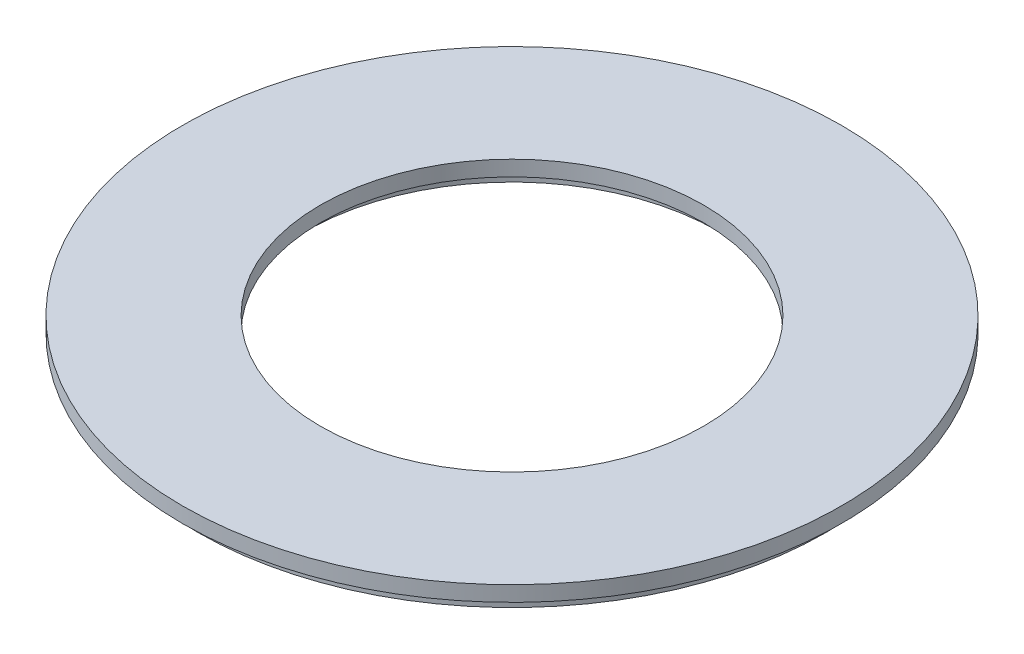
ISO-10303-21;
HEADER;
FILE_DESCRIPTION(('STEP AP214'),'2;1');
FILE_NAME('part.step','',(''),(''),'','','');
FILE_SCHEMA(('AUTOMOTIVE_DESIGN { 1 0 10303 214 1 1 1 1 }'));
ENDSEC;
DATA;
#1=APPLICATION_CONTEXT('core data for automotive mechanical design processes');
#2=APPLICATION_PROTOCOL_DEFINITION('international standard','automotive_design',2000,#1);
#3=PRODUCT_CONTEXT('',#1,'mechanical');
#4=PRODUCT('Part','Part','',(#3));
#5=PRODUCT_RELATED_PRODUCT_CATEGORY('part','',(#4));
#6=PRODUCT_DEFINITION_FORMATION('','',#4);
#7=PRODUCT_DEFINITION_CONTEXT('part definition',#1,'design');
#8=PRODUCT_DEFINITION('design','',#6,#7);
#9=PRODUCT_DEFINITION_SHAPE('','',#8);
#10=(LENGTH_UNIT() NAMED_UNIT(*) SI_UNIT(.MILLI.,.METRE.));
#11=(NAMED_UNIT(*) PLANE_ANGLE_UNIT() SI_UNIT($,.RADIAN.));
#12=(NAMED_UNIT(*) SI_UNIT($,.STERADIAN.) SOLID_ANGLE_UNIT());
#13=UNCERTAINTY_MEASURE_WITH_UNIT(LENGTH_MEASURE(1.E-05),#10,'distance_accuracy_value','');
#14=(GEOMETRIC_REPRESENTATION_CONTEXT(3) GLOBAL_UNCERTAINTY_ASSIGNED_CONTEXT((#13)) GLOBAL_UNIT_ASSIGNED_CONTEXT((#10,
#11,#12)) REPRESENTATION_CONTEXT('',''));
#15=CARTESIAN_POINT('',(0.,0.,0.));
#16=DIRECTION('',(0.,0.,1.));
#17=DIRECTION('',(1.,0.,0.));
#18=AXIS2_PLACEMENT_3D('',#15,#16,#17);
#19=CARTESIAN_POINT('',(0.,0.,0.));
#20=DIRECTION('',(0.,1.,0.));
#21=DIRECTION('',(0.,0.,1.));
#22=AXIS2_PLACEMENT_3D('',#19,#20,#21);
#23=PLANE('',#22);
#24=CARTESIAN_POINT('',(0.,0.,0.));
#25=DIRECTION('',(0.,1.,0.));
#26=DIRECTION('',(0.,0.,1.));
#27=AXIS2_PLACEMENT_3D('',#24,#25,#26);
#28=CIRCLE('',#27,12.5);
#29=CARTESIAN_POINT('',(0.,0.,12.5));
#30=VERTEX_POINT('',#29);
#31=EDGE_CURVE('E49',#30,#30,#28,.T.);
#32=ORIENTED_EDGE('',*,*,#31,.T.);
#33=EDGE_LOOP('',(#32));
#34=FACE_BOUND('',#33,.T.);
#35=CARTESIAN_POINT('',(0.,0.,0.));
#36=DIRECTION('',(0.,-1.,0.));
#37=DIRECTION('',(0.,0.,-1.));
#38=AXIS2_PLACEMENT_3D('',#35,#36,#37);
#39=CIRCLE('',#38,13.5);
#40=CARTESIAN_POINT('',(0.,0.,-13.5));
#41=VERTEX_POINT('',#40);
#42=EDGE_CURVE('E58',#41,#41,#39,.T.);
#43=ORIENTED_EDGE('',*,*,#42,.T.);
#44=EDGE_LOOP('',(#43));
#45=FACE_BOUND('',#44,.T.);
#46=ADVANCED_FACE('F31',(#34,#45),#23,.F.);
#47=CARTESIAN_POINT('',(0.,1.,0.));
#48=DIRECTION('',(0.,1.,0.));
#49=DIRECTION('',(0.,0.,1.));
#50=AXIS2_PLACEMENT_3D('',#47,#48,#49);
#51=PLANE('',#50);
#52=CARTESIAN_POINT('',(0.,1.,0.));
#53=DIRECTION('',(0.,1.,0.));
#54=DIRECTION('',(0.,0.,1.));
#55=AXIS2_PLACEMENT_3D('',#52,#53,#54);
#56=CIRCLE('',#55,21.5);
#57=CARTESIAN_POINT('',(0.,1.,21.5));
#58=VERTEX_POINT('',#57);
#59=EDGE_CURVE('E38',#58,#58,#56,.T.);
#60=ORIENTED_EDGE('',*,*,#59,.T.);
#61=EDGE_LOOP('',(#60));
#62=FACE_BOUND('',#61,.T.);
#63=CARTESIAN_POINT('',(0.,1.,0.));
#64=DIRECTION('',(0.,1.,0.));
#65=DIRECTION('',(0.,0.,1.));
#66=AXIS2_PLACEMENT_3D('',#63,#64,#65);
#67=CIRCLE('',#66,12.5);
#68=CARTESIAN_POINT('',(0.,1.,12.5));
#69=VERTEX_POINT('',#68);
#70=EDGE_CURVE('E47',#69,#69,#67,.T.);
#71=ORIENTED_EDGE('',*,*,#70,.F.);
#72=EDGE_LOOP('',(#71));
#73=FACE_BOUND('',#72,.T.);
#74=ADVANCED_FACE('F83',(#62,#73),#51,.T.);
#75=CARTESIAN_POINT('',(0.,0.,0.));
#76=DIRECTION('',(0.,1.,0.));
#77=DIRECTION('',(0.,0.,1.));
#78=AXIS2_PLACEMENT_3D('',#75,#76,#77);
#79=CIRCLE('',#78,20.5);
#80=CARTESIAN_POINT('',(0.,0.,20.5));
#81=VERTEX_POINT('',#80);
#82=EDGE_CURVE('E10',#81,#81,#79,.F.);
#83=ORIENTED_EDGE('',*,*,#82,.F.);
#84=EDGE_LOOP('',(#83));
#85=FACE_BOUND('',#84,.T.);
#86=CARTESIAN_POINT('',(0.,0.,0.));
#87=DIRECTION('',(0.,1.,0.));
#88=DIRECTION('',(0.,0.,1.));
#89=AXIS2_PLACEMENT_3D('',#86,#87,#88);
#90=CIRCLE('',#89,21.5);
#91=CARTESIAN_POINT('',(0.,0.,21.5));
#92=VERTEX_POINT('',#91);
#93=EDGE_CURVE('E42',#92,#92,#90,.T.);
#94=ORIENTED_EDGE('',*,*,#93,.F.);
#95=EDGE_LOOP('',(#94));
#96=FACE_BOUND('',#95,.T.);
#97=ADVANCED_FACE('F85',(#85,#96),#23,.F.);
#98=CARTESIAN_POINT('',(0.,1.,0.));
#99=DIRECTION('',(0.,-1.,0.));
#100=DIRECTION('',(0.,0.,-1.));
#101=AXIS2_PLACEMENT_3D('',#98,#99,#100);
#102=CYLINDRICAL_SURFACE('',#101,21.5);
#103=ORIENTED_EDGE('',*,*,#59,.F.);
#104=EDGE_LOOP('',(#103));
#105=FACE_BOUND('',#104,.T.);
#106=ORIENTED_EDGE('',*,*,#93,.T.);
#107=EDGE_LOOP('',(#106));
#108=FACE_BOUND('',#107,.T.);
#109=ADVANCED_FACE('F33',(#105,#108),#102,.T.);
#110=CARTESIAN_POINT('',(0.,1.,0.));
#111=DIRECTION('',(0.,-1.,0.));
#112=DIRECTION('',(0.,0.,-1.));
#113=AXIS2_PLACEMENT_3D('',#110,#111,#112);
#114=CYLINDRICAL_SURFACE('',#113,12.5);
#115=ORIENTED_EDGE('',*,*,#70,.T.);
#116=EDGE_LOOP('',(#115));
#117=FACE_BOUND('',#116,.T.);
#118=ORIENTED_EDGE('',*,*,#31,.F.);
#119=EDGE_LOOP('',(#118));
#120=FACE_BOUND('',#119,.T.);
#121=ADVANCED_FACE('F70',(#117,#120),#114,.F.);
#122=CARTESIAN_POINT('',(0.,-1.,0.));
#123=DIRECTION('',(0.,-1.,0.));
#124=DIRECTION('',(0.,0.,-1.));
#125=AXIS2_PLACEMENT_3D('',#122,#123,#124);
#126=PLANE('',#125);
#127=CARTESIAN_POINT('',(0.,-1.,0.));
#128=DIRECTION('',(0.,-1.,0.));
#129=DIRECTION('',(0.,0.,-1.));
#130=AXIS2_PLACEMENT_3D('',#127,#128,#129);
#131=CIRCLE('',#130,20.5);
#132=CARTESIAN_POINT('',(0.,-1.,-20.5));
#133=VERTEX_POINT('',#132);
#134=EDGE_CURVE('E52',#133,#133,#131,.T.);
#135=ORIENTED_EDGE('',*,*,#134,.T.);
#136=EDGE_LOOP('',(#135));
#137=FACE_BOUND('',#136,.T.);
#138=CARTESIAN_POINT('',(0.,-1.,0.));
#139=DIRECTION('',(0.,-1.,0.));
#140=DIRECTION('',(0.,0.,-1.));
#141=AXIS2_PLACEMENT_3D('',#138,#139,#140);
#142=CIRCLE('',#141,13.5);
#143=CARTESIAN_POINT('',(0.,-1.,-13.5));
#144=VERTEX_POINT('',#143);
#145=EDGE_CURVE('E57',#144,#144,#142,.T.);
#146=ORIENTED_EDGE('',*,*,#145,.F.);
#147=EDGE_LOOP('',(#146));
#148=FACE_BOUND('',#147,.T.);
#149=ADVANCED_FACE('F67',(#137,#148),#126,.T.);
#150=CARTESIAN_POINT('',(0.,-1.,0.));
#151=DIRECTION('',(0.,1.,0.));
#152=DIRECTION('',(0.,0.,1.));
#153=AXIS2_PLACEMENT_3D('',#150,#151,#152);
#154=CYLINDRICAL_SURFACE('',#153,20.5);
#155=ORIENTED_EDGE('',*,*,#134,.F.);
#156=EDGE_LOOP('',(#155));
#157=FACE_BOUND('',#156,.T.);
#158=ORIENTED_EDGE('',*,*,#82,.T.);
#159=EDGE_LOOP('',(#158));
#160=FACE_BOUND('',#159,.T.);
#161=ADVANCED_FACE('F69',(#157,#160),#154,.T.);
#162=CARTESIAN_POINT('',(0.,-1.,0.));
#163=DIRECTION('',(0.,1.,0.));
#164=DIRECTION('',(0.,0.,1.));
#165=AXIS2_PLACEMENT_3D('',#162,#163,#164);
#166=CYLINDRICAL_SURFACE('',#165,13.5);
#167=ORIENTED_EDGE('',*,*,#145,.T.);
#168=EDGE_LOOP('',(#167));
#169=FACE_BOUND('',#168,.T.);
#170=ORIENTED_EDGE('',*,*,#42,.F.);
#171=EDGE_LOOP('',(#170));
#172=FACE_BOUND('',#171,.T.);
#173=ADVANCED_FACE('F64',(#169,#172),#166,.F.);
#174=CLOSED_SHELL('',(#46,#74,#97,#109,#121,#149,#161,#173));
#175=MANIFOLD_SOLID_BREP('B2',#174);
#176=ADVANCED_BREP_SHAPE_REPRESENTATION('',(#18,#175),#14);
#177=SHAPE_DEFINITION_REPRESENTATION(#9,#176);
ENDSEC;
END-ISO-10303-21;
